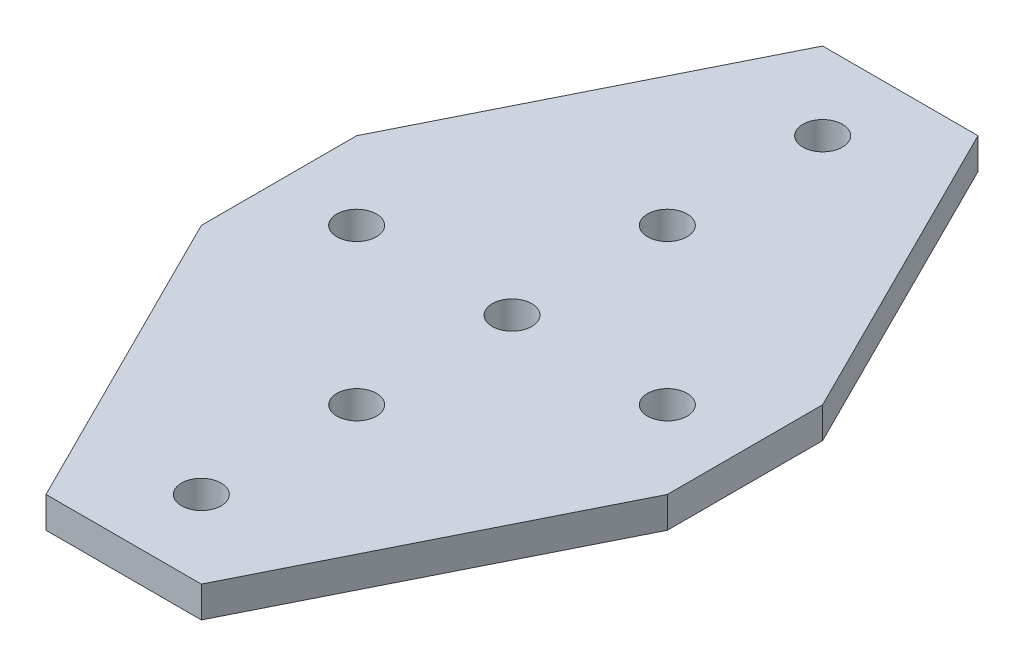
ISO-10303-21;
HEADER;
FILE_DESCRIPTION(('STEP AP214'),'2;1');
FILE_NAME('part.step','',(''),(''),'','','');
FILE_SCHEMA(('AUTOMOTIVE_DESIGN { 1 0 10303 214 1 1 1 1 }'));
ENDSEC;
DATA;
#1=APPLICATION_CONTEXT('core data for automotive mechanical design processes');
#2=APPLICATION_PROTOCOL_DEFINITION('international standard','automotive_design',2000,#1);
#3=PRODUCT_CONTEXT('',#1,'mechanical');
#4=PRODUCT('Part','Part','',(#3));
#5=PRODUCT_RELATED_PRODUCT_CATEGORY('part','',(#4));
#6=PRODUCT_DEFINITION_FORMATION('','',#4);
#7=PRODUCT_DEFINITION_CONTEXT('part definition',#1,'design');
#8=PRODUCT_DEFINITION('design','',#6,#7);
#9=PRODUCT_DEFINITION_SHAPE('','',#8);
#10=(LENGTH_UNIT() NAMED_UNIT(*) SI_UNIT(.MILLI.,.METRE.));
#11=(NAMED_UNIT(*) PLANE_ANGLE_UNIT() SI_UNIT($,.RADIAN.));
#12=(NAMED_UNIT(*) SI_UNIT($,.STERADIAN.) SOLID_ANGLE_UNIT());
#13=UNCERTAINTY_MEASURE_WITH_UNIT(LENGTH_MEASURE(1.E-05),#10,'distance_accuracy_value','');
#14=(GEOMETRIC_REPRESENTATION_CONTEXT(3) GLOBAL_UNCERTAINTY_ASSIGNED_CONTEXT((#13)) GLOBAL_UNIT_ASSIGNED_CONTEXT((#10,
#11,#12)) REPRESENTATION_CONTEXT('',''));
#15=CARTESIAN_POINT('',(0.,0.,0.));
#16=DIRECTION('',(0.,0.,1.));
#17=DIRECTION('',(1.,0.,0.));
#18=AXIS2_PLACEMENT_3D('',#15,#16,#17);
#19=CARTESIAN_POINT('',(0.,4.,0.));
#20=DIRECTION('',(0.,-1.,0.));
#21=DIRECTION('',(0.,0.,-1.));
#22=AXIS2_PLACEMENT_3D('',#19,#20,#21);
#23=PLANE('',#22);
#24=CARTESIAN_POINT('',(-20.,4.,0.));
#25=DIRECTION('',(0.,1.,0.));
#26=DIRECTION('',(0.,0.,1.));
#27=AXIS2_PLACEMENT_3D('',#24,#25,#26);
#28=CIRCLE('',#27,2.55);
#29=CARTESIAN_POINT('',(-20.,4.,2.55));
#30=VERTEX_POINT('',#29);
#31=EDGE_CURVE('E208',#30,#30,#28,.T.);
#32=ORIENTED_EDGE('',*,*,#31,.F.);
#33=EDGE_LOOP('',(#32));
#34=FACE_BOUND('',#33,.T.);
#35=CARTESIAN_POINT('',(0.,4.,20.));
#36=DIRECTION('',(0.,1.,0.));
#37=DIRECTION('',(0.,0.,-1.));
#38=AXIS2_PLACEMENT_3D('',#35,#36,#37);
#39=CIRCLE('',#38,2.55);
#40=CARTESIAN_POINT('',(0.,4.,17.45));
#41=VERTEX_POINT('',#40);
#42=EDGE_CURVE('E196',#41,#41,#39,.T.);
#43=ORIENTED_EDGE('',*,*,#42,.F.);
#44=EDGE_LOOP('',(#43));
#45=FACE_BOUND('',#44,.T.);
#46=CARTESIAN_POINT('',(0.,4.,0.));
#47=DIRECTION('',(0.,1.,0.));
#48=DIRECTION('',(0.,0.,1.));
#49=AXIS2_PLACEMENT_3D('',#46,#47,#48);
#50=CIRCLE('',#49,2.55);
#51=CARTESIAN_POINT('',(0.,4.,2.55));
#52=VERTEX_POINT('',#51);
#53=EDGE_CURVE('E184',#52,#52,#50,.T.);
#54=ORIENTED_EDGE('',*,*,#53,.F.);
#55=EDGE_LOOP('',(#54));
#56=FACE_BOUND('',#55,.T.);
#57=DIRECTION('',(0.,0.,-1.));
#58=VECTOR('',#57,1.);
#59=CARTESIAN_POINT('',(30.,4.,10.));
#60=LINE('',#59,#58);
#61=CARTESIAN_POINT('',(30.,4.,10.));
#62=VERTEX_POINT('',#61);
#63=CARTESIAN_POINT('',(30.,4.,-10.));
#64=VERTEX_POINT('',#63);
#65=EDGE_CURVE('E147',#62,#64,#60,.T.);
#66=ORIENTED_EDGE('',*,*,#65,.T.);
#67=DIRECTION('',(-0.447213595499958,0.,-0.894427190999916));
#68=VECTOR('',#67,1.);
#69=CARTESIAN_POINT('',(30.,4.,-10.));
#70=LINE('',#69,#68);
#71=CARTESIAN_POINT('',(10.,4.,-50.));
#72=VERTEX_POINT('',#71);
#73=EDGE_CURVE('E95',#64,#72,#70,.T.);
#74=ORIENTED_EDGE('',*,*,#73,.T.);
#75=DIRECTION('',(-1.,0.,0.));
#76=VECTOR('',#75,1.);
#77=CARTESIAN_POINT('',(-10.,4.,-50.));
#78=LINE('',#77,#76);
#79=CARTESIAN_POINT('',(-10.,4.,-50.));
#80=VERTEX_POINT('',#79);
#81=EDGE_CURVE('E162',#72,#80,#78,.T.);
#82=ORIENTED_EDGE('',*,*,#81,.T.);
#83=DIRECTION('',(-0.447213595499958,0.,0.894427190999916));
#84=VECTOR('',#83,1.);
#85=CARTESIAN_POINT('',(-30.,4.,-10.));
#86=LINE('',#85,#84);
#87=CARTESIAN_POINT('',(-30.,4.,-10.));
#88=VERTEX_POINT('',#87);
#89=EDGE_CURVE('E175',#80,#88,#86,.T.);
#90=ORIENTED_EDGE('',*,*,#89,.T.);
#91=DIRECTION('',(0.,0.,1.));
#92=VECTOR('',#91,1.);
#93=CARTESIAN_POINT('',(-30.,4.,10.));
#94=LINE('',#93,#92);
#95=CARTESIAN_POINT('',(-30.,4.,10.));
#96=VERTEX_POINT('',#95);
#97=EDGE_CURVE('E114',#88,#96,#94,.T.);
#98=ORIENTED_EDGE('',*,*,#97,.T.);
#99=DIRECTION('',(0.447213595499958,0.,0.894427190999916));
#100=VECTOR('',#99,1.);
#101=CARTESIAN_POINT('',(-30.,4.,10.));
#102=LINE('',#101,#100);
#103=CARTESIAN_POINT('',(-10.,4.,50.));
#104=VERTEX_POINT('',#103);
#105=EDGE_CURVE('E108',#96,#104,#102,.T.);
#106=ORIENTED_EDGE('',*,*,#105,.T.);
#107=DIRECTION('',(1.,0.,0.));
#108=VECTOR('',#107,1.);
#109=CARTESIAN_POINT('',(-10.,4.,50.));
#110=LINE('',#109,#108);
#111=CARTESIAN_POINT('',(10.,4.,50.));
#112=VERTEX_POINT('',#111);
#113=EDGE_CURVE('E112',#104,#112,#110,.T.);
#114=ORIENTED_EDGE('',*,*,#113,.T.);
#115=DIRECTION('',(0.447213595499958,0.,-0.894427190999916));
#116=VECTOR('',#115,1.);
#117=CARTESIAN_POINT('',(30.,4.,10.));
#118=LINE('',#117,#116);
#119=EDGE_CURVE('E52',#112,#62,#118,.T.);
#120=ORIENTED_EDGE('',*,*,#119,.T.);
#121=EDGE_LOOP('',(#66,#74,#82,#90,#98,#106,#114,#120));
#122=FACE_BOUND('',#121,.T.);
#123=CARTESIAN_POINT('',(0.,4.,-20.));
#124=DIRECTION('',(0.,1.,0.));
#125=DIRECTION('',(0.,0.,1.));
#126=AXIS2_PLACEMENT_3D('',#123,#124,#125);
#127=CIRCLE('',#126,2.55);
#128=CARTESIAN_POINT('',(0.,4.,-17.45));
#129=VERTEX_POINT('',#128);
#130=EDGE_CURVE('E136',#129,#129,#127,.T.);
#131=ORIENTED_EDGE('',*,*,#130,.F.);
#132=EDGE_LOOP('',(#131));
#133=FACE_BOUND('',#132,.T.);
#134=CARTESIAN_POINT('',(0.,4.,-40.));
#135=DIRECTION('',(0.,1.,0.));
#136=DIRECTION('',(0.,0.,1.));
#137=AXIS2_PLACEMENT_3D('',#134,#135,#136);
#138=CIRCLE('',#137,2.55);
#139=CARTESIAN_POINT('',(0.,4.,-37.45));
#140=VERTEX_POINT('',#139);
#141=EDGE_CURVE('E190',#140,#140,#138,.T.);
#142=ORIENTED_EDGE('',*,*,#141,.F.);
#143=EDGE_LOOP('',(#142));
#144=FACE_BOUND('',#143,.T.);
#145=CARTESIAN_POINT('',(0.,4.,40.));
#146=DIRECTION('',(0.,1.,0.));
#147=DIRECTION('',(0.,0.,-1.));
#148=AXIS2_PLACEMENT_3D('',#145,#146,#147);
#149=CIRCLE('',#148,2.55);
#150=CARTESIAN_POINT('',(0.,4.,37.45));
#151=VERTEX_POINT('',#150);
#152=EDGE_CURVE('E202',#151,#151,#149,.T.);
#153=ORIENTED_EDGE('',*,*,#152,.F.);
#154=EDGE_LOOP('',(#153));
#155=FACE_BOUND('',#154,.T.);
#156=CARTESIAN_POINT('',(20.,4.,0.));
#157=DIRECTION('',(0.,1.,0.));
#158=DIRECTION('',(0.,0.,-1.));
#159=AXIS2_PLACEMENT_3D('',#156,#157,#158);
#160=CIRCLE('',#159,2.55);
#161=CARTESIAN_POINT('',(20.,4.,-2.55));
#162=VERTEX_POINT('',#161);
#163=EDGE_CURVE('E214',#162,#162,#160,.T.);
#164=ORIENTED_EDGE('',*,*,#163,.F.);
#165=EDGE_LOOP('',(#164));
#166=FACE_BOUND('',#165,.T.);
#167=ADVANCED_FACE('F35',(#34,#45,#56,#122,#133,#144,#155,#166),#23,.F.);
#168=CARTESIAN_POINT('',(0.,0.,0.));
#169=DIRECTION('',(0.,-1.,0.));
#170=DIRECTION('',(0.,0.,-1.));
#171=AXIS2_PLACEMENT_3D('',#168,#169,#170);
#172=PLANE('',#171);
#173=CARTESIAN_POINT('',(-20.,0.,0.));
#174=DIRECTION('',(0.,1.,0.));
#175=DIRECTION('',(0.,0.,1.));
#176=AXIS2_PLACEMENT_3D('',#173,#174,#175);
#177=CIRCLE('',#176,2.55);
#178=CARTESIAN_POINT('',(-20.,0.,2.55));
#179=VERTEX_POINT('',#178);
#180=EDGE_CURVE('E211',#179,#179,#177,.T.);
#181=ORIENTED_EDGE('',*,*,#180,.T.);
#182=EDGE_LOOP('',(#181));
#183=FACE_BOUND('',#182,.T.);
#184=CARTESIAN_POINT('',(0.,0.,20.));
#185=DIRECTION('',(0.,1.,0.));
#186=DIRECTION('',(0.,0.,-1.));
#187=AXIS2_PLACEMENT_3D('',#184,#185,#186);
#188=CIRCLE('',#187,2.55);
#189=CARTESIAN_POINT('',(0.,0.,17.45));
#190=VERTEX_POINT('',#189);
#191=EDGE_CURVE('E199',#190,#190,#188,.T.);
#192=ORIENTED_EDGE('',*,*,#191,.T.);
#193=EDGE_LOOP('',(#192));
#194=FACE_BOUND('',#193,.T.);
#195=CARTESIAN_POINT('',(0.,0.,0.));
#196=DIRECTION('',(0.,1.,0.));
#197=DIRECTION('',(0.,0.,1.));
#198=AXIS2_PLACEMENT_3D('',#195,#196,#197);
#199=CIRCLE('',#198,2.55);
#200=CARTESIAN_POINT('',(0.,0.,2.55));
#201=VERTEX_POINT('',#200);
#202=EDGE_CURVE('E187',#201,#201,#199,.T.);
#203=ORIENTED_EDGE('',*,*,#202,.T.);
#204=EDGE_LOOP('',(#203));
#205=FACE_BOUND('',#204,.T.);
#206=DIRECTION('',(0.,0.,-1.));
#207=VECTOR('',#206,1.);
#208=CARTESIAN_POINT('',(30.,0.,10.));
#209=LINE('',#208,#207);
#210=CARTESIAN_POINT('',(30.,0.,10.));
#211=VERTEX_POINT('',#210);
#212=CARTESIAN_POINT('',(30.,0.,-10.));
#213=VERTEX_POINT('',#212);
#214=EDGE_CURVE('E132',#211,#213,#209,.T.);
#215=ORIENTED_EDGE('',*,*,#214,.F.);
#216=DIRECTION('',(0.447213595499958,0.,-0.894427190999916));
#217=VECTOR('',#216,1.);
#218=CARTESIAN_POINT('',(30.,0.,10.));
#219=LINE('',#218,#217);
#220=CARTESIAN_POINT('',(10.,0.,50.));
#221=VERTEX_POINT('',#220);
#222=EDGE_CURVE('E87',#221,#211,#219,.T.);
#223=ORIENTED_EDGE('',*,*,#222,.F.);
#224=DIRECTION('',(1.,0.,0.));
#225=VECTOR('',#224,1.);
#226=CARTESIAN_POINT('',(-10.,0.,50.));
#227=LINE('',#226,#225);
#228=CARTESIAN_POINT('',(-10.,0.,50.));
#229=VERTEX_POINT('',#228);
#230=EDGE_CURVE('E81',#229,#221,#227,.T.);
#231=ORIENTED_EDGE('',*,*,#230,.F.);
#232=DIRECTION('',(0.447213595499958,0.,0.894427190999916));
#233=VECTOR('',#232,1.);
#234=CARTESIAN_POINT('',(-30.,0.,10.));
#235=LINE('',#234,#233);
#236=CARTESIAN_POINT('',(-30.,0.,10.));
#237=VERTEX_POINT('',#236);
#238=EDGE_CURVE('E122',#237,#229,#235,.T.);
#239=ORIENTED_EDGE('',*,*,#238,.F.);
#240=DIRECTION('',(0.,0.,1.));
#241=VECTOR('',#240,1.);
#242=CARTESIAN_POINT('',(-30.,0.,10.));
#243=LINE('',#242,#241);
#244=CARTESIAN_POINT('',(-30.,0.,-10.));
#245=VERTEX_POINT('',#244);
#246=EDGE_CURVE('E142',#245,#237,#243,.T.);
#247=ORIENTED_EDGE('',*,*,#246,.F.);
#248=DIRECTION('',(-0.447213595499958,0.,0.894427190999916));
#249=VECTOR('',#248,1.);
#250=CARTESIAN_POINT('',(-30.,0.,-10.));
#251=LINE('',#250,#249);
#252=CARTESIAN_POINT('',(-10.,0.,-50.));
#253=VERTEX_POINT('',#252);
#254=EDGE_CURVE('E140',#253,#245,#251,.T.);
#255=ORIENTED_EDGE('',*,*,#254,.F.);
#256=DIRECTION('',(-1.,0.,0.));
#257=VECTOR('',#256,1.);
#258=CARTESIAN_POINT('',(-10.,0.,-50.));
#259=LINE('',#258,#257);
#260=CARTESIAN_POINT('',(10.,0.,-50.));
#261=VERTEX_POINT('',#260);
#262=EDGE_CURVE('E138',#261,#253,#259,.T.);
#263=ORIENTED_EDGE('',*,*,#262,.F.);
#264=DIRECTION('',(-0.447213595499958,0.,-0.894427190999916));
#265=VECTOR('',#264,1.);
#266=CARTESIAN_POINT('',(30.,0.,-10.));
#267=LINE('',#266,#265);
#268=EDGE_CURVE('E135',#213,#261,#267,.T.);
#269=ORIENTED_EDGE('',*,*,#268,.F.);
#270=EDGE_LOOP('',(#215,#223,#231,#239,#247,#255,#263,#269));
#271=FACE_BOUND('',#270,.T.);
#272=CARTESIAN_POINT('',(0.,0.,-20.));
#273=DIRECTION('',(0.,1.,0.));
#274=DIRECTION('',(0.,0.,1.));
#275=AXIS2_PLACEMENT_3D('',#272,#273,#274);
#276=CIRCLE('',#275,2.55);
#277=CARTESIAN_POINT('',(0.,0.,-17.45));
#278=VERTEX_POINT('',#277);
#279=EDGE_CURVE('E181',#278,#278,#276,.T.);
#280=ORIENTED_EDGE('',*,*,#279,.T.);
#281=EDGE_LOOP('',(#280));
#282=FACE_BOUND('',#281,.T.);
#283=CARTESIAN_POINT('',(0.,0.,-40.));
#284=DIRECTION('',(0.,1.,0.));
#285=DIRECTION('',(0.,0.,1.));
#286=AXIS2_PLACEMENT_3D('',#283,#284,#285);
#287=CIRCLE('',#286,2.55);
#288=CARTESIAN_POINT('',(0.,0.,-37.45));
#289=VERTEX_POINT('',#288);
#290=EDGE_CURVE('E193',#289,#289,#287,.T.);
#291=ORIENTED_EDGE('',*,*,#290,.T.);
#292=EDGE_LOOP('',(#291));
#293=FACE_BOUND('',#292,.T.);
#294=CARTESIAN_POINT('',(0.,0.,40.));
#295=DIRECTION('',(0.,1.,0.));
#296=DIRECTION('',(0.,0.,-1.));
#297=AXIS2_PLACEMENT_3D('',#294,#295,#296);
#298=CIRCLE('',#297,2.55);
#299=CARTESIAN_POINT('',(0.,0.,37.45));
#300=VERTEX_POINT('',#299);
#301=EDGE_CURVE('E205',#300,#300,#298,.T.);
#302=ORIENTED_EDGE('',*,*,#301,.T.);
#303=EDGE_LOOP('',(#302));
#304=FACE_BOUND('',#303,.T.);
#305=CARTESIAN_POINT('',(20.,0.,0.));
#306=DIRECTION('',(0.,1.,0.));
#307=DIRECTION('',(0.,0.,-1.));
#308=AXIS2_PLACEMENT_3D('',#305,#306,#307);
#309=CIRCLE('',#308,2.55);
#310=CARTESIAN_POINT('',(20.,0.,-2.55));
#311=VERTEX_POINT('',#310);
#312=EDGE_CURVE('E217',#311,#311,#309,.T.);
#313=ORIENTED_EDGE('',*,*,#312,.T.);
#314=EDGE_LOOP('',(#313));
#315=FACE_BOUND('',#314,.T.);
#316=ADVANCED_FACE('F166',(#183,#194,#205,#271,#282,#293,#304,#315),#172,.T.);
#317=CARTESIAN_POINT('',(30.,4.,10.));
#318=DIRECTION('',(-1.,0.,0.));
#319=DIRECTION('',(0.,0.,1.));
#320=AXIS2_PLACEMENT_3D('',#317,#318,#319);
#321=PLANE('',#320);
#322=ORIENTED_EDGE('',*,*,#214,.T.);
#323=DIRECTION('',(0.,-1.,0.));
#324=VECTOR('',#323,1.);
#325=CARTESIAN_POINT('',(30.,4.,-10.));
#326=LINE('',#325,#324);
#327=EDGE_CURVE('E11',#64,#213,#326,.T.);
#328=ORIENTED_EDGE('',*,*,#327,.F.);
#329=ORIENTED_EDGE('',*,*,#65,.F.);
#330=DIRECTION('',(0.,-1.,0.));
#331=VECTOR('',#330,1.);
#332=CARTESIAN_POINT('',(30.,4.,10.));
#333=LINE('',#332,#331);
#334=EDGE_CURVE('E128',#62,#211,#333,.T.);
#335=ORIENTED_EDGE('',*,*,#334,.T.);
#336=EDGE_LOOP('',(#322,#328,#329,#335));
#337=FACE_BOUND('',#336,.T.);
#338=ADVANCED_FACE('F37',(#337),#321,.F.);
#339=CARTESIAN_POINT('',(30.,4.,-10.));
#340=DIRECTION('',(-0.894427190999916,0.,0.447213595499958));
#341=DIRECTION('',(0.447213595499958,0.,0.894427190999916));
#342=AXIS2_PLACEMENT_3D('',#339,#340,#341);
#343=PLANE('',#342);
#344=ORIENTED_EDGE('',*,*,#268,.T.);
#345=DIRECTION('',(0.,-1.,0.));
#346=VECTOR('',#345,1.);
#347=CARTESIAN_POINT('',(10.,4.,-50.));
#348=LINE('',#347,#346);
#349=EDGE_CURVE('E44',#72,#261,#348,.T.);
#350=ORIENTED_EDGE('',*,*,#349,.F.);
#351=ORIENTED_EDGE('',*,*,#73,.F.);
#352=ORIENTED_EDGE('',*,*,#327,.T.);
#353=EDGE_LOOP('',(#344,#350,#351,#352));
#354=FACE_BOUND('',#353,.T.);
#355=ADVANCED_FACE('F252',(#354),#343,.F.);
#356=CARTESIAN_POINT('',(-10.,4.,-50.));
#357=DIRECTION('',(0.,0.,1.));
#358=DIRECTION('',(1.,0.,0.));
#359=AXIS2_PLACEMENT_3D('',#356,#357,#358);
#360=PLANE('',#359);
#361=ORIENTED_EDGE('',*,*,#262,.T.);
#362=DIRECTION('',(0.,-1.,0.));
#363=VECTOR('',#362,1.);
#364=CARTESIAN_POINT('',(-10.,4.,-50.));
#365=LINE('',#364,#363);
#366=EDGE_CURVE('E154',#80,#253,#365,.T.);
#367=ORIENTED_EDGE('',*,*,#366,.F.);
#368=ORIENTED_EDGE('',*,*,#81,.F.);
#369=ORIENTED_EDGE('',*,*,#349,.T.);
#370=EDGE_LOOP('',(#361,#367,#368,#369));
#371=FACE_BOUND('',#370,.T.);
#372=ADVANCED_FACE('F160',(#371),#360,.F.);
#373=CARTESIAN_POINT('',(-30.,4.,-10.));
#374=DIRECTION('',(0.894427190999916,0.,0.447213595499958));
#375=DIRECTION('',(0.447213595499958,0.,-0.894427190999916));
#376=AXIS2_PLACEMENT_3D('',#373,#374,#375);
#377=PLANE('',#376);
#378=ORIENTED_EDGE('',*,*,#254,.T.);
#379=DIRECTION('',(0.,-1.,0.));
#380=VECTOR('',#379,1.);
#381=CARTESIAN_POINT('',(-30.,4.,-10.));
#382=LINE('',#381,#380);
#383=EDGE_CURVE('E151',#88,#245,#382,.T.);
#384=ORIENTED_EDGE('',*,*,#383,.F.);
#385=ORIENTED_EDGE('',*,*,#89,.F.);
#386=ORIENTED_EDGE('',*,*,#366,.T.);
#387=EDGE_LOOP('',(#378,#384,#385,#386));
#388=FACE_BOUND('',#387,.T.);
#389=ADVANCED_FACE('F171',(#388),#377,.F.);
#390=CARTESIAN_POINT('',(-30.,4.,10.));
#391=DIRECTION('',(1.,0.,0.));
#392=DIRECTION('',(0.,0.,-1.));
#393=AXIS2_PLACEMENT_3D('',#390,#391,#392);
#394=PLANE('',#393);
#395=ORIENTED_EDGE('',*,*,#246,.T.);
#396=DIRECTION('',(0.,-1.,0.));
#397=VECTOR('',#396,1.);
#398=CARTESIAN_POINT('',(-30.,4.,10.));
#399=LINE('',#398,#397);
#400=EDGE_CURVE('E123',#96,#237,#399,.T.);
#401=ORIENTED_EDGE('',*,*,#400,.F.);
#402=ORIENTED_EDGE('',*,*,#97,.F.);
#403=ORIENTED_EDGE('',*,*,#383,.T.);
#404=EDGE_LOOP('',(#395,#401,#402,#403));
#405=FACE_BOUND('',#404,.T.);
#406=ADVANCED_FACE('F174',(#405),#394,.F.);
#407=CARTESIAN_POINT('',(-30.,4.,10.));
#408=DIRECTION('',(0.894427190999916,0.,-0.447213595499958));
#409=DIRECTION('',(-0.447213595499958,0.,-0.894427190999916));
#410=AXIS2_PLACEMENT_3D('',#407,#408,#409);
#411=PLANE('',#410);
#412=ORIENTED_EDGE('',*,*,#238,.T.);
#413=DIRECTION('',(0.,-1.,0.));
#414=VECTOR('',#413,1.);
#415=CARTESIAN_POINT('',(-10.,4.,50.));
#416=LINE('',#415,#414);
#417=EDGE_CURVE('E119',#104,#229,#416,.T.);
#418=ORIENTED_EDGE('',*,*,#417,.F.);
#419=ORIENTED_EDGE('',*,*,#105,.F.);
#420=ORIENTED_EDGE('',*,*,#400,.T.);
#421=EDGE_LOOP('',(#412,#418,#419,#420));
#422=FACE_BOUND('',#421,.T.);
#423=ADVANCED_FACE('F120',(#422),#411,.F.);
#424=CARTESIAN_POINT('',(-10.,4.,50.));
#425=DIRECTION('',(0.,0.,-1.));
#426=DIRECTION('',(-1.,0.,0.));
#427=AXIS2_PLACEMENT_3D('',#424,#425,#426);
#428=PLANE('',#427);
#429=ORIENTED_EDGE('',*,*,#230,.T.);
#430=DIRECTION('',(0.,-1.,0.));
#431=VECTOR('',#430,1.);
#432=CARTESIAN_POINT('',(10.,4.,50.));
#433=LINE('',#432,#431);
#434=EDGE_CURVE('E124',#112,#221,#433,.T.);
#435=ORIENTED_EDGE('',*,*,#434,.F.);
#436=ORIENTED_EDGE('',*,*,#113,.F.);
#437=ORIENTED_EDGE('',*,*,#417,.T.);
#438=EDGE_LOOP('',(#429,#435,#436,#437));
#439=FACE_BOUND('',#438,.T.);
#440=ADVANCED_FACE('F126',(#439),#428,.F.);
#441=CARTESIAN_POINT('',(30.,4.,10.));
#442=DIRECTION('',(-0.894427190999916,0.,-0.447213595499958));
#443=DIRECTION('',(-0.447213595499958,0.,0.894427190999916));
#444=AXIS2_PLACEMENT_3D('',#441,#442,#443);
#445=PLANE('',#444);
#446=ORIENTED_EDGE('',*,*,#222,.T.);
#447=ORIENTED_EDGE('',*,*,#334,.F.);
#448=ORIENTED_EDGE('',*,*,#119,.F.);
#449=ORIENTED_EDGE('',*,*,#434,.T.);
#450=EDGE_LOOP('',(#446,#447,#448,#449));
#451=FACE_BOUND('',#450,.T.);
#452=ADVANCED_FACE('F240',(#451),#445,.F.);
#453=CARTESIAN_POINT('',(0.,4.,-20.));
#454=DIRECTION('',(0.,-1.,0.));
#455=DIRECTION('',(0.,0.,-1.));
#456=AXIS2_PLACEMENT_3D('',#453,#454,#455);
#457=CYLINDRICAL_SURFACE('',#456,2.55);
#458=ORIENTED_EDGE('',*,*,#130,.T.);
#459=EDGE_LOOP('',(#458));
#460=FACE_BOUND('',#459,.T.);
#461=ORIENTED_EDGE('',*,*,#279,.F.);
#462=EDGE_LOOP('',(#461));
#463=FACE_BOUND('',#462,.T.);
#464=ADVANCED_FACE('F237',(#460,#463),#457,.F.);
#465=CARTESIAN_POINT('',(0.,4.,0.));
#466=DIRECTION('',(0.,-1.,0.));
#467=DIRECTION('',(0.,0.,-1.));
#468=AXIS2_PLACEMENT_3D('',#465,#466,#467);
#469=CYLINDRICAL_SURFACE('',#468,2.55);
#470=ORIENTED_EDGE('',*,*,#53,.T.);
#471=EDGE_LOOP('',(#470));
#472=FACE_BOUND('',#471,.T.);
#473=ORIENTED_EDGE('',*,*,#202,.F.);
#474=EDGE_LOOP('',(#473));
#475=FACE_BOUND('',#474,.T.);
#476=ADVANCED_FACE('F316',(#472,#475),#469,.F.);
#477=CARTESIAN_POINT('',(0.,4.,-40.));
#478=DIRECTION('',(0.,-1.,0.));
#479=DIRECTION('',(0.,0.,-1.));
#480=AXIS2_PLACEMENT_3D('',#477,#478,#479);
#481=CYLINDRICAL_SURFACE('',#480,2.55);
#482=ORIENTED_EDGE('',*,*,#141,.T.);
#483=EDGE_LOOP('',(#482));
#484=FACE_BOUND('',#483,.T.);
#485=ORIENTED_EDGE('',*,*,#290,.F.);
#486=EDGE_LOOP('',(#485));
#487=FACE_BOUND('',#486,.T.);
#488=ADVANCED_FACE('F324',(#484,#487),#481,.F.);
#489=CARTESIAN_POINT('',(0.,4.,20.));
#490=DIRECTION('',(0.,-1.,0.));
#491=DIRECTION('',(0.,0.,-1.));
#492=AXIS2_PLACEMENT_3D('',#489,#490,#491);
#493=CYLINDRICAL_SURFACE('',#492,2.55);
#494=ORIENTED_EDGE('',*,*,#42,.T.);
#495=EDGE_LOOP('',(#494));
#496=FACE_BOUND('',#495,.T.);
#497=ORIENTED_EDGE('',*,*,#191,.F.);
#498=EDGE_LOOP('',(#497));
#499=FACE_BOUND('',#498,.T.);
#500=ADVANCED_FACE('F332',(#496,#499),#493,.F.);
#501=CARTESIAN_POINT('',(0.,4.,40.));
#502=DIRECTION('',(0.,-1.,0.));
#503=DIRECTION('',(0.,0.,-1.));
#504=AXIS2_PLACEMENT_3D('',#501,#502,#503);
#505=CYLINDRICAL_SURFACE('',#504,2.55);
#506=ORIENTED_EDGE('',*,*,#152,.T.);
#507=EDGE_LOOP('',(#506));
#508=FACE_BOUND('',#507,.T.);
#509=ORIENTED_EDGE('',*,*,#301,.F.);
#510=EDGE_LOOP('',(#509));
#511=FACE_BOUND('',#510,.T.);
#512=ADVANCED_FACE('F341',(#508,#511),#505,.F.);
#513=CARTESIAN_POINT('',(-20.,4.,0.));
#514=DIRECTION('',(0.,-1.,0.));
#515=DIRECTION('',(0.,0.,-1.));
#516=AXIS2_PLACEMENT_3D('',#513,#514,#515);
#517=CYLINDRICAL_SURFACE('',#516,2.55);
#518=ORIENTED_EDGE('',*,*,#31,.T.);
#519=EDGE_LOOP('',(#518));
#520=FACE_BOUND('',#519,.T.);
#521=ORIENTED_EDGE('',*,*,#180,.F.);
#522=EDGE_LOOP('',(#521));
#523=FACE_BOUND('',#522,.T.);
#524=ADVANCED_FACE('F350',(#520,#523),#517,.F.);
#525=CARTESIAN_POINT('',(20.,4.,0.));
#526=DIRECTION('',(0.,-1.,0.));
#527=DIRECTION('',(0.,0.,-1.));
#528=AXIS2_PLACEMENT_3D('',#525,#526,#527);
#529=CYLINDRICAL_SURFACE('',#528,2.55);
#530=ORIENTED_EDGE('',*,*,#163,.T.);
#531=EDGE_LOOP('',(#530));
#532=FACE_BOUND('',#531,.T.);
#533=ORIENTED_EDGE('',*,*,#312,.F.);
#534=EDGE_LOOP('',(#533));
#535=FACE_BOUND('',#534,.T.);
#536=ADVANCED_FACE('F223',(#532,#535),#529,.F.);
#537=CLOSED_SHELL('',(#167,#316,#338,#355,#372,#389,#406,#423,#440,#452,#464,#476,#488,#500,
#512,#524,#536));
#538=MANIFOLD_SOLID_BREP('B2',#537);
#539=ADVANCED_BREP_SHAPE_REPRESENTATION('',(#18,#538),#14);
#540=SHAPE_DEFINITION_REPRESENTATION(#9,#539);
ENDSEC;
END-ISO-10303-21;
